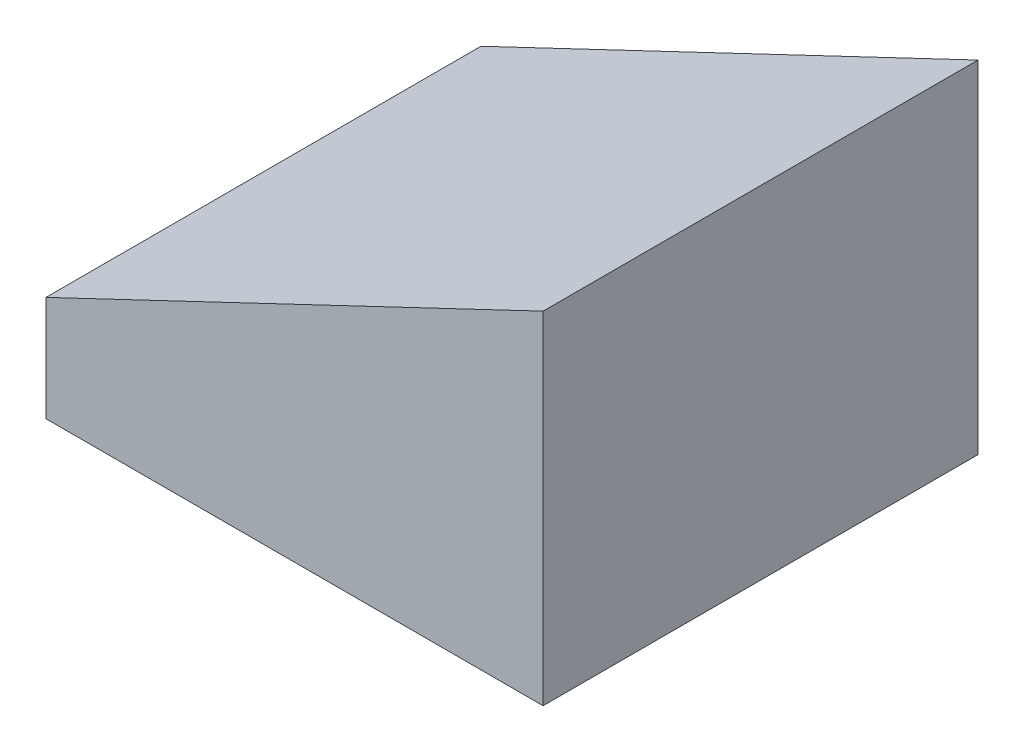
ISO-10303-21;
HEADER;
FILE_DESCRIPTION(('STEP AP214'),'2;1');
FILE_NAME('part.step','',(''),(''),'','','');
FILE_SCHEMA(('AUTOMOTIVE_DESIGN { 1 0 10303 214 1 1 1 1 }'));
ENDSEC;
DATA;
#1=APPLICATION_CONTEXT('core data for automotive mechanical design processes');
#2=APPLICATION_PROTOCOL_DEFINITION('international standard','automotive_design',2000,#1);
#3=PRODUCT_CONTEXT('',#1,'mechanical');
#4=PRODUCT('Part','Part','',(#3));
#5=PRODUCT_RELATED_PRODUCT_CATEGORY('part','',(#4));
#6=PRODUCT_DEFINITION_FORMATION('','',#4);
#7=PRODUCT_DEFINITION_CONTEXT('part definition',#1,'design');
#8=PRODUCT_DEFINITION('design','',#6,#7);
#9=PRODUCT_DEFINITION_SHAPE('','',#8);
#10=(LENGTH_UNIT() NAMED_UNIT(*) SI_UNIT(.MILLI.,.METRE.));
#11=(NAMED_UNIT(*) PLANE_ANGLE_UNIT() SI_UNIT($,.RADIAN.));
#12=(NAMED_UNIT(*) SI_UNIT($,.STERADIAN.) SOLID_ANGLE_UNIT());
#13=UNCERTAINTY_MEASURE_WITH_UNIT(LENGTH_MEASURE(1.E-05),#10,'distance_accuracy_value','');
#14=(GEOMETRIC_REPRESENTATION_CONTEXT(3) GLOBAL_UNCERTAINTY_ASSIGNED_CONTEXT((#13)) GLOBAL_UNIT_ASSIGNED_CONTEXT((#10,
#11,#12)) REPRESENTATION_CONTEXT('',''));
#15=CARTESIAN_POINT('',(0.,0.,0.));
#16=DIRECTION('',(0.,0.,1.));
#17=DIRECTION('',(1.,0.,0.));
#18=AXIS2_PLACEMENT_3D('',#15,#16,#17);
#19=CARTESIAN_POINT('',(-5.08,-3.175,4.445));
#20=DIRECTION('',(1.,0.,0.));
#21=DIRECTION('',(0.,0.,-1.));
#22=AXIS2_PLACEMENT_3D('',#19,#20,#21);
#23=PLANE('',#22);
#24=DIRECTION('',(0.,-1.,0.));
#25=VECTOR('',#24,1.);
#26=CARTESIAN_POINT('',(-5.08,-3.175,4.445));
#27=LINE('',#26,#25);
#28=CARTESIAN_POINT('',(-5.08,-1.02601325713042,4.445));
#29=VERTEX_POINT('',#28);
#30=CARTESIAN_POINT('',(-5.08,-3.175,4.445));
#31=VERTEX_POINT('',#30);
#32=EDGE_CURVE('E93',#29,#31,#27,.T.);
#33=ORIENTED_EDGE('',*,*,#32,.F.);
#34=DIRECTION('',(0.,0.,1.));
#35=VECTOR('',#34,1.);
#36=CARTESIAN_POINT('',(-5.08,-1.02601325713042,-4.445));
#37=LINE('',#36,#35);
#38=CARTESIAN_POINT('',(-5.08,-1.02601325713042,-4.445));
#39=VERTEX_POINT('',#38);
#40=EDGE_CURVE('E138',#39,#29,#37,.T.);
#41=ORIENTED_EDGE('',*,*,#40,.F.);
#42=DIRECTION('',(0.,-1.,0.));
#43=VECTOR('',#42,1.);
#44=CARTESIAN_POINT('',(-5.08,-3.175,-4.445));
#45=LINE('',#44,#43);
#46=CARTESIAN_POINT('',(-5.08,-3.175,-4.445));
#47=VERTEX_POINT('',#46);
#48=EDGE_CURVE('E80',#39,#47,#45,.T.);
#49=ORIENTED_EDGE('',*,*,#48,.T.);
#50=DIRECTION('',(0.,0.,-1.));
#51=VECTOR('',#50,1.);
#52=CARTESIAN_POINT('',(-5.08,-3.175,4.445));
#53=LINE('',#52,#51);
#54=EDGE_CURVE('E12',#31,#47,#53,.T.);
#55=ORIENTED_EDGE('',*,*,#54,.F.);
#56=EDGE_LOOP('',(#33,#41,#49,#55));
#57=FACE_BOUND('',#56,.T.);
#58=ADVANCED_FACE('F36',(#57),#23,.F.);
#59=CARTESIAN_POINT('',(5.08,-3.175,4.445));
#60=DIRECTION('',(0.,1.,0.));
#61=DIRECTION('',(-1.,0.,0.));
#62=AXIS2_PLACEMENT_3D('',#59,#60,#61);
#63=PLANE('',#62);
#64=DIRECTION('',(0.,0.,-1.));
#65=VECTOR('',#64,1.);
#66=CARTESIAN_POINT('',(-2.54,-3.175,2.54));
#67=LINE('',#66,#65);
#68=CARTESIAN_POINT('',(-2.54,-3.175,2.54));
#69=VERTEX_POINT('',#68);
#70=CARTESIAN_POINT('',(-2.54,-3.175,-2.54));
#71=VERTEX_POINT('',#70);
#72=EDGE_CURVE('E118',#69,#71,#67,.T.);
#73=ORIENTED_EDGE('',*,*,#72,.F.);
#74=DIRECTION('',(-1.,0.,0.));
#75=VECTOR('',#74,1.);
#76=CARTESIAN_POINT('',(2.54,-3.175,2.54));
#77=LINE('',#76,#75);
#78=CARTESIAN_POINT('',(2.54,-3.175,2.54));
#79=VERTEX_POINT('',#78);
#80=EDGE_CURVE('E50',#79,#69,#77,.T.);
#81=ORIENTED_EDGE('',*,*,#80,.F.);
#82=DIRECTION('',(0.,0.,1.));
#83=VECTOR('',#82,1.);
#84=CARTESIAN_POINT('',(2.54,-3.175,-2.54));
#85=LINE('',#84,#83);
#86=CARTESIAN_POINT('',(2.54,-3.175,-2.54));
#87=VERTEX_POINT('',#86);
#88=EDGE_CURVE('E111',#87,#79,#85,.T.);
#89=ORIENTED_EDGE('',*,*,#88,.F.);
#90=DIRECTION('',(1.,0.,0.));
#91=VECTOR('',#90,1.);
#92=CARTESIAN_POINT('',(-2.54,-3.175,-2.54));
#93=LINE('',#92,#91);
#94=EDGE_CURVE('E115',#71,#87,#93,.T.);
#95=ORIENTED_EDGE('',*,*,#94,.F.);
#96=EDGE_LOOP('',(#73,#81,#89,#95));
#97=FACE_BOUND('',#96,.T.);
#98=DIRECTION('',(1.,0.,0.));
#99=VECTOR('',#98,1.);
#100=CARTESIAN_POINT('',(5.08,-3.175,-4.445));
#101=LINE('',#100,#99);
#102=CARTESIAN_POINT('',(5.08,-3.175,-4.445));
#103=VERTEX_POINT('',#102);
#104=EDGE_CURVE('E71',#47,#103,#101,.T.);
#105=ORIENTED_EDGE('',*,*,#104,.T.);
#106=DIRECTION('',(0.,0.,-1.));
#107=VECTOR('',#106,1.);
#108=CARTESIAN_POINT('',(5.08,-3.175,4.445));
#109=LINE('',#108,#107);
#110=CARTESIAN_POINT('',(5.08,-3.175,4.445));
#111=VERTEX_POINT('',#110);
#112=EDGE_CURVE('E43',#111,#103,#109,.T.);
#113=ORIENTED_EDGE('',*,*,#112,.F.);
#114=DIRECTION('',(1.,0.,0.));
#115=VECTOR('',#114,1.);
#116=CARTESIAN_POINT('',(5.08,-3.175,4.445));
#117=LINE('',#116,#115);
#118=EDGE_CURVE('E59',#31,#111,#117,.T.);
#119=ORIENTED_EDGE('',*,*,#118,.F.);
#120=ORIENTED_EDGE('',*,*,#54,.T.);
#121=EDGE_LOOP('',(#105,#113,#119,#120));
#122=FACE_BOUND('',#121,.T.);
#123=ADVANCED_FACE('F73',(#97,#122),#63,.F.);
#124=CARTESIAN_POINT('',(5.08,0.,4.445));
#125=DIRECTION('',(-1.,0.,0.));
#126=DIRECTION('',(0.,0.,1.));
#127=AXIS2_PLACEMENT_3D('',#124,#125,#126);
#128=PLANE('',#127);
#129=DIRECTION('',(0.,1.,0.));
#130=VECTOR('',#129,1.);
#131=CARTESIAN_POINT('',(5.08,0.,-4.445));
#132=LINE('',#131,#130);
#133=CARTESIAN_POINT('',(5.08,3.81,-4.445));
#134=VERTEX_POINT('',#133);
#135=EDGE_CURVE('E79',#103,#134,#132,.T.);
#136=ORIENTED_EDGE('',*,*,#135,.T.);
#137=DIRECTION('',(0.,0.,-1.));
#138=VECTOR('',#137,1.);
#139=CARTESIAN_POINT('',(5.08,3.81,13.3099440318152));
#140=LINE('',#139,#138);
#141=CARTESIAN_POINT('',(5.08,3.81,4.445));
#142=VERTEX_POINT('',#141);
#143=EDGE_CURVE('E135',#142,#134,#140,.T.);
#144=ORIENTED_EDGE('',*,*,#143,.F.);
#145=DIRECTION('',(0.,1.,0.));
#146=VECTOR('',#145,1.);
#147=CARTESIAN_POINT('',(5.08,0.,4.445));
#148=LINE('',#147,#146);
#149=EDGE_CURVE('E88',#111,#142,#148,.T.);
#150=ORIENTED_EDGE('',*,*,#149,.F.);
#151=ORIENTED_EDGE('',*,*,#112,.T.);
#152=EDGE_LOOP('',(#136,#144,#150,#151));
#153=FACE_BOUND('',#152,.T.);
#154=ADVANCED_FACE('F84',(#153),#128,.F.);
#155=CARTESIAN_POINT('',(0.,0.,4.445));
#156=DIRECTION('',(0.,0.,-1.));
#157=DIRECTION('',(-1.,0.,0.));
#158=AXIS2_PLACEMENT_3D('',#155,#156,#157);
#159=PLANE('',#158);
#160=DIRECTION('',(0.902932328686211,0.429782747226197,0.));
#161=VECTOR('',#160,1.);
#162=CARTESIAN_POINT('',(-2.9244445583198,0.,4.445));
#163=LINE('',#162,#161);
#164=EDGE_CURVE('E122',#29,#142,#163,.T.);
#165=ORIENTED_EDGE('',*,*,#164,.F.);
#166=ORIENTED_EDGE('',*,*,#32,.T.);
#167=ORIENTED_EDGE('',*,*,#118,.T.);
#168=ORIENTED_EDGE('',*,*,#149,.T.);
#169=EDGE_LOOP('',(#165,#166,#167,#168));
#170=FACE_BOUND('',#169,.T.);
#171=ADVANCED_FACE('F150',(#170),#159,.F.);
#172=CARTESIAN_POINT('',(0.,0.,-4.445));
#173=DIRECTION('',(0.,0.,-1.));
#174=DIRECTION('',(-1.,0.,0.));
#175=AXIS2_PLACEMENT_3D('',#172,#173,#174);
#176=PLANE('',#175);
#177=ORIENTED_EDGE('',*,*,#48,.F.);
#178=DIRECTION('',(-0.902932328686211,-0.429782747226197,0.));
#179=VECTOR('',#178,1.);
#180=CARTESIAN_POINT('',(-2.9244445583198,0.,-4.445));
#181=LINE('',#180,#179);
#182=EDGE_CURVE('E92',#134,#39,#181,.T.);
#183=ORIENTED_EDGE('',*,*,#182,.F.);
#184=ORIENTED_EDGE('',*,*,#135,.F.);
#185=ORIENTED_EDGE('',*,*,#104,.F.);
#186=EDGE_LOOP('',(#177,#183,#184,#185));
#187=FACE_BOUND('',#186,.T.);
#188=ADVANCED_FACE('F90',(#187),#176,.T.);
#189=CARTESIAN_POINT('',(2.54,-1.27,2.54));
#190=DIRECTION('',(0.,0.,1.));
#191=DIRECTION('',(1.,0.,0.));
#192=AXIS2_PLACEMENT_3D('',#189,#190,#191);
#193=PLANE('',#192);
#194=ORIENTED_EDGE('',*,*,#80,.T.);
#195=DIRECTION('',(0.,-1.,0.));
#196=VECTOR('',#195,1.);
#197=CARTESIAN_POINT('',(-2.54,-1.27,2.54));
#198=LINE('',#197,#196);
#199=CARTESIAN_POINT('',(-2.54,-1.27,2.54));
#200=VERTEX_POINT('',#199);
#201=EDGE_CURVE('E101',#200,#69,#198,.T.);
#202=ORIENTED_EDGE('',*,*,#201,.F.);
#203=DIRECTION('',(-1.,0.,0.));
#204=VECTOR('',#203,1.);
#205=CARTESIAN_POINT('',(2.54,-1.27,2.54));
#206=LINE('',#205,#204);
#207=CARTESIAN_POINT('',(2.54,-1.27,2.54));
#208=VERTEX_POINT('',#207);
#209=EDGE_CURVE('E114',#208,#200,#206,.T.);
#210=ORIENTED_EDGE('',*,*,#209,.F.);
#211=DIRECTION('',(0.,-1.,0.));
#212=VECTOR('',#211,1.);
#213=CARTESIAN_POINT('',(2.54,-1.27,2.54));
#214=LINE('',#213,#212);
#215=EDGE_CURVE('E98',#208,#79,#214,.T.);
#216=ORIENTED_EDGE('',*,*,#215,.T.);
#217=EDGE_LOOP('',(#194,#202,#210,#216));
#218=FACE_BOUND('',#217,.T.);
#219=ADVANCED_FACE('F170',(#218),#193,.F.);
#220=CARTESIAN_POINT('',(2.54,-1.27,-2.54));
#221=DIRECTION('',(1.,0.,0.));
#222=DIRECTION('',(0.,1.,0.));
#223=AXIS2_PLACEMENT_3D('',#220,#221,#222);
#224=PLANE('',#223);
#225=ORIENTED_EDGE('',*,*,#88,.T.);
#226=ORIENTED_EDGE('',*,*,#215,.F.);
#227=DIRECTION('',(0.,0.,1.));
#228=VECTOR('',#227,1.);
#229=CARTESIAN_POINT('',(2.54,-1.27,-2.54));
#230=LINE('',#229,#228);
#231=CARTESIAN_POINT('',(2.54,-1.27,-2.54));
#232=VERTEX_POINT('',#231);
#233=EDGE_CURVE('E104',#232,#208,#230,.T.);
#234=ORIENTED_EDGE('',*,*,#233,.F.);
#235=DIRECTION('',(0.,-1.,0.));
#236=VECTOR('',#235,1.);
#237=CARTESIAN_POINT('',(2.54,-1.27,-2.54));
#238=LINE('',#237,#236);
#239=EDGE_CURVE('E107',#232,#87,#238,.T.);
#240=ORIENTED_EDGE('',*,*,#239,.T.);
#241=EDGE_LOOP('',(#225,#226,#234,#240));
#242=FACE_BOUND('',#241,.T.);
#243=ADVANCED_FACE('F174',(#242),#224,.F.);
#244=CARTESIAN_POINT('',(-2.54,-1.27,-2.54));
#245=DIRECTION('',(0.,0.,-1.));
#246=DIRECTION('',(-1.,0.,0.));
#247=AXIS2_PLACEMENT_3D('',#244,#245,#246);
#248=PLANE('',#247);
#249=ORIENTED_EDGE('',*,*,#94,.T.);
#250=ORIENTED_EDGE('',*,*,#239,.F.);
#251=DIRECTION('',(1.,0.,0.));
#252=VECTOR('',#251,1.);
#253=CARTESIAN_POINT('',(-2.54,-1.27,-2.54));
#254=LINE('',#253,#252);
#255=CARTESIAN_POINT('',(-2.54,-1.27,-2.54));
#256=VERTEX_POINT('',#255);
#257=EDGE_CURVE('E125',#256,#232,#254,.T.);
#258=ORIENTED_EDGE('',*,*,#257,.F.);
#259=DIRECTION('',(0.,-1.,0.));
#260=VECTOR('',#259,1.);
#261=CARTESIAN_POINT('',(-2.54,-1.27,-2.54));
#262=LINE('',#261,#260);
#263=EDGE_CURVE('E103',#256,#71,#262,.T.);
#264=ORIENTED_EDGE('',*,*,#263,.T.);
#265=EDGE_LOOP('',(#249,#250,#258,#264));
#266=FACE_BOUND('',#265,.T.);
#267=ADVANCED_FACE('F185',(#266),#248,.F.);
#268=CARTESIAN_POINT('',(-2.54,-1.27,2.54));
#269=DIRECTION('',(-1.,0.,0.));
#270=DIRECTION('',(0.,-1.,0.));
#271=AXIS2_PLACEMENT_3D('',#268,#269,#270);
#272=PLANE('',#271);
#273=ORIENTED_EDGE('',*,*,#72,.T.);
#274=ORIENTED_EDGE('',*,*,#263,.F.);
#275=DIRECTION('',(0.,0.,-1.));
#276=VECTOR('',#275,1.);
#277=CARTESIAN_POINT('',(-2.54,-1.27,2.54));
#278=LINE('',#277,#276);
#279=EDGE_CURVE('E128',#200,#256,#278,.T.);
#280=ORIENTED_EDGE('',*,*,#279,.F.);
#281=ORIENTED_EDGE('',*,*,#201,.T.);
#282=EDGE_LOOP('',(#273,#274,#280,#281));
#283=FACE_BOUND('',#282,.T.);
#284=ADVANCED_FACE('F179',(#283),#272,.F.);
#285=CARTESIAN_POINT('',(0.,-1.27,0.));
#286=DIRECTION('',(0.,-1.,0.));
#287=DIRECTION('',(1.,0.,0.));
#288=AXIS2_PLACEMENT_3D('',#285,#286,#287);
#289=PLANE('',#288);
#290=ORIENTED_EDGE('',*,*,#209,.T.);
#291=ORIENTED_EDGE('',*,*,#279,.T.);
#292=ORIENTED_EDGE('',*,*,#257,.T.);
#293=ORIENTED_EDGE('',*,*,#233,.T.);
#294=EDGE_LOOP('',(#290,#291,#292,#293));
#295=FACE_BOUND('',#294,.T.);
#296=ADVANCED_FACE('F183',(#295),#289,.T.);
#297=CARTESIAN_POINT('',(-2.9244445583198,0.,13.3099440318152));
#298=DIRECTION('',(0.429782747226197,-0.902932328686211,0.));
#299=DIRECTION('',(0.902932328686211,0.429782747226197,0.));
#300=AXIS2_PLACEMENT_3D('',#297,#298,#299);
#301=PLANE('',#300);
#302=ORIENTED_EDGE('',*,*,#182,.T.);
#303=ORIENTED_EDGE('',*,*,#40,.T.);
#304=ORIENTED_EDGE('',*,*,#164,.T.);
#305=ORIENTED_EDGE('',*,*,#143,.T.);
#306=EDGE_LOOP('',(#302,#303,#304,#305));
#307=FACE_BOUND('',#306,.T.);
#308=ADVANCED_FACE('F144',(#307),#301,.F.);
#309=CLOSED_SHELL('',(#58,#123,#154,#171,#188,#219,#243,#267,#284,#296,#308));
#310=MANIFOLD_SOLID_BREP('B2',#309);
#311=ADVANCED_BREP_SHAPE_REPRESENTATION('',(#18,#310),#14);
#312=SHAPE_DEFINITION_REPRESENTATION(#9,#311);
ENDSEC;
END-ISO-10303-21;
